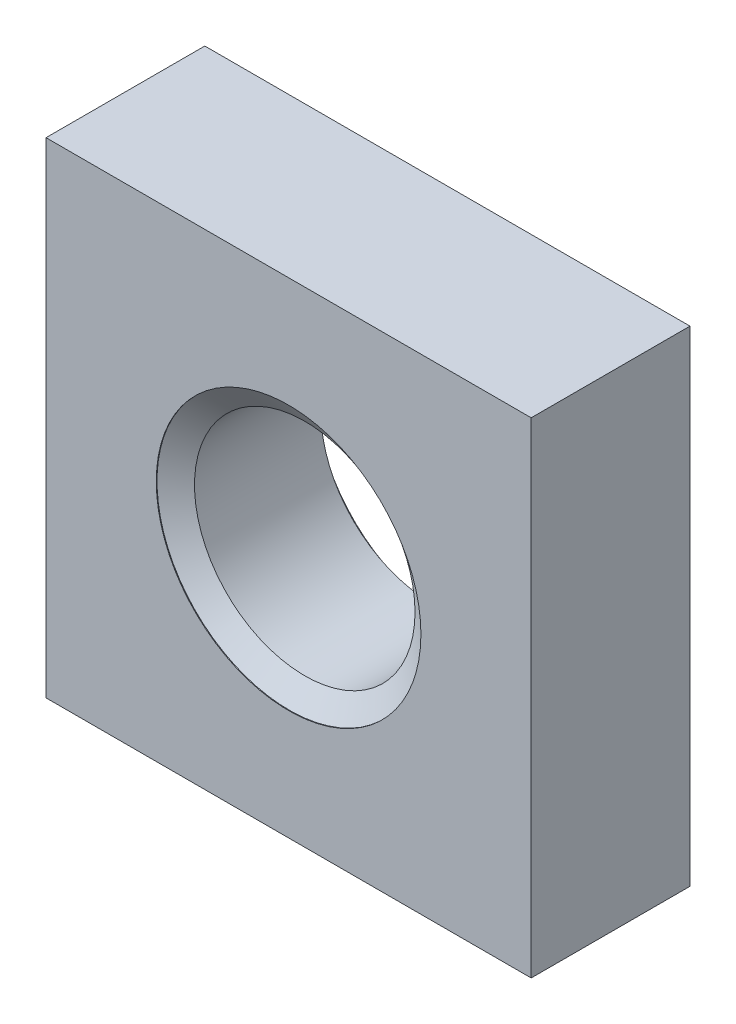
ISO-10303-21;
HEADER;
FILE_DESCRIPTION(('STEP AP214'),'2;1');
FILE_NAME('part.step','',(''),(''),'','','');
FILE_SCHEMA(('AUTOMOTIVE_DESIGN { 1 0 10303 214 1 1 1 1 }'));
ENDSEC;
DATA;
#1=APPLICATION_CONTEXT('core data for automotive mechanical design processes');
#2=APPLICATION_PROTOCOL_DEFINITION('international standard','automotive_design',2000,#1);
#3=PRODUCT_CONTEXT('',#1,'mechanical');
#4=PRODUCT('Part','Part','',(#3));
#5=PRODUCT_RELATED_PRODUCT_CATEGORY('part','',(#4));
#6=PRODUCT_DEFINITION_FORMATION('','',#4);
#7=PRODUCT_DEFINITION_CONTEXT('part definition',#1,'design');
#8=PRODUCT_DEFINITION('design','',#6,#7);
#9=PRODUCT_DEFINITION_SHAPE('','',#8);
#10=(LENGTH_UNIT() NAMED_UNIT(*) SI_UNIT(.MILLI.,.METRE.));
#11=(NAMED_UNIT(*) PLANE_ANGLE_UNIT() SI_UNIT($,.RADIAN.));
#12=(NAMED_UNIT(*) SI_UNIT($,.STERADIAN.) SOLID_ANGLE_UNIT());
#13=UNCERTAINTY_MEASURE_WITH_UNIT(LENGTH_MEASURE(1.E-05),#10,'distance_accuracy_value','');
#14=(GEOMETRIC_REPRESENTATION_CONTEXT(3) GLOBAL_UNCERTAINTY_ASSIGNED_CONTEXT((#13)) GLOBAL_UNIT_ASSIGNED_CONTEXT((#10,
#11,#12)) REPRESENTATION_CONTEXT('',''));
#15=CARTESIAN_POINT('',(0.,0.,0.));
#16=DIRECTION('',(0.,0.,1.));
#17=DIRECTION('',(1.,0.,0.));
#18=AXIS2_PLACEMENT_3D('',#15,#16,#17);
#19=CARTESIAN_POINT('',(0.,0.,-1.8));
#20=DIRECTION('',(0.,0.,1.));
#21=DIRECTION('',(1.,0.,0.));
#22=AXIS2_PLACEMENT_3D('',#19,#20,#21);
#23=CYLINDRICAL_SURFACE('',#22,1.25);
#24=CARTESIAN_POINT('',(0.,0.,-0.183051884552424));
#25=DIRECTION('',(0.,0.,1.));
#26=DIRECTION('',(1.,0.,0.));
#27=AXIS2_PLACEMENT_3D('',#24,#25,#26);
#28=CIRCLE('',#27,1.25);
#29=CARTESIAN_POINT('',(1.25,0.,-0.183051884552424));
#30=VERTEX_POINT('',#29);
#31=EDGE_CURVE('E96',#30,#30,#28,.F.);
#32=ORIENTED_EDGE('',*,*,#31,.F.);
#33=EDGE_LOOP('',(#32));
#34=FACE_BOUND('',#33,.T.);
#35=CARTESIAN_POINT('',(0.,0.,-1.61594811544757));
#36=DIRECTION('',(0.,0.,-1.));
#37=DIRECTION('',(-1.,0.,0.));
#38=AXIS2_PLACEMENT_3D('',#35,#36,#37);
#39=CIRCLE('',#38,1.25);
#40=CARTESIAN_POINT('',(-1.25,0.,-1.61594811544757));
#41=VERTEX_POINT('',#40);
#42=EDGE_CURVE('E21',#41,#41,#39,.F.);
#43=ORIENTED_EDGE('',*,*,#42,.F.);
#44=EDGE_LOOP('',(#43));
#45=FACE_BOUND('',#44,.T.);
#46=ADVANCED_FACE('F17',(#34,#45),#23,.F.);
#47=CARTESIAN_POINT('',(-2.75,-2.75,-1.8));
#48=DIRECTION('',(-1.,0.,0.));
#49=DIRECTION('',(0.,0.,1.));
#50=AXIS2_PLACEMENT_3D('',#47,#48,#49);
#51=PLANE('',#50);
#52=DIRECTION('',(0.,-1.,0.));
#53=VECTOR('',#52,1.);
#54=CARTESIAN_POINT('',(-2.75,-2.75,0.));
#55=LINE('',#54,#53);
#56=CARTESIAN_POINT('',(-2.75,2.75,0.));
#57=VERTEX_POINT('',#56);
#58=CARTESIAN_POINT('',(-2.75,-2.75,0.));
#59=VERTEX_POINT('',#58);
#60=EDGE_CURVE('E85',#57,#59,#55,.T.);
#61=ORIENTED_EDGE('',*,*,#60,.F.);
#62=DIRECTION('',(0.,0.,1.));
#63=VECTOR('',#62,1.);
#64=CARTESIAN_POINT('',(-2.75,2.75,-1.8));
#65=LINE('',#64,#63);
#66=CARTESIAN_POINT('',(-2.75,2.75,-1.8));
#67=VERTEX_POINT('',#66);
#68=EDGE_CURVE('E11',#67,#57,#65,.T.);
#69=ORIENTED_EDGE('',*,*,#68,.F.);
#70=DIRECTION('',(0.,-1.,0.));
#71=VECTOR('',#70,1.);
#72=CARTESIAN_POINT('',(-2.75,-2.75,-1.8));
#73=LINE('',#72,#71);
#74=CARTESIAN_POINT('',(-2.75,-2.75,-1.8));
#75=VERTEX_POINT('',#74);
#76=EDGE_CURVE('E78',#67,#75,#73,.T.);
#77=ORIENTED_EDGE('',*,*,#76,.T.);
#78=DIRECTION('',(0.,0.,1.));
#79=VECTOR('',#78,1.);
#80=CARTESIAN_POINT('',(-2.75,-2.75,-1.8));
#81=LINE('',#80,#79);
#82=EDGE_CURVE('E61',#75,#59,#81,.T.);
#83=ORIENTED_EDGE('',*,*,#82,.T.);
#84=EDGE_LOOP('',(#61,#69,#77,#83));
#85=FACE_BOUND('',#84,.T.);
#86=ADVANCED_FACE('F19',(#85),#51,.T.);
#87=CARTESIAN_POINT('',(-2.75,2.75,-1.8));
#88=DIRECTION('',(0.,1.,0.));
#89=DIRECTION('',(-1.,0.,0.));
#90=AXIS2_PLACEMENT_3D('',#87,#88,#89);
#91=PLANE('',#90);
#92=DIRECTION('',(-1.,0.,0.));
#93=VECTOR('',#92,1.);
#94=CARTESIAN_POINT('',(-2.75,2.75,0.));
#95=LINE('',#94,#93);
#96=CARTESIAN_POINT('',(2.75,2.75,0.));
#97=VERTEX_POINT('',#96);
#98=EDGE_CURVE('E80',#97,#57,#95,.T.);
#99=ORIENTED_EDGE('',*,*,#98,.F.);
#100=DIRECTION('',(0.,0.,1.));
#101=VECTOR('',#100,1.);
#102=CARTESIAN_POINT('',(2.75,2.75,-1.8));
#103=LINE('',#102,#101);
#104=CARTESIAN_POINT('',(2.75,2.75,-1.8));
#105=VERTEX_POINT('',#104);
#106=EDGE_CURVE('E27',#105,#97,#103,.T.);
#107=ORIENTED_EDGE('',*,*,#106,.F.);
#108=DIRECTION('',(-1.,0.,0.));
#109=VECTOR('',#108,1.);
#110=CARTESIAN_POINT('',(-2.75,2.75,-1.8));
#111=LINE('',#110,#109);
#112=EDGE_CURVE('E75',#105,#67,#111,.T.);
#113=ORIENTED_EDGE('',*,*,#112,.T.);
#114=ORIENTED_EDGE('',*,*,#68,.T.);
#115=EDGE_LOOP('',(#99,#107,#113,#114));
#116=FACE_BOUND('',#115,.T.);
#117=ADVANCED_FACE('F127',(#116),#91,.T.);
#118=CARTESIAN_POINT('',(2.75,-2.75,-1.8));
#119=DIRECTION('',(1.,0.,0.));
#120=DIRECTION('',(0.,1.,0.));
#121=AXIS2_PLACEMENT_3D('',#118,#119,#120);
#122=PLANE('',#121);
#123=DIRECTION('',(0.,1.,0.));
#124=VECTOR('',#123,1.);
#125=CARTESIAN_POINT('',(2.75,-2.75,0.));
#126=LINE('',#125,#124);
#127=CARTESIAN_POINT('',(2.75,-2.75,0.));
#128=VERTEX_POINT('',#127);
#129=EDGE_CURVE('E69',#128,#97,#126,.T.);
#130=ORIENTED_EDGE('',*,*,#129,.F.);
#131=DIRECTION('',(0.,0.,1.));
#132=VECTOR('',#131,1.);
#133=CARTESIAN_POINT('',(2.75,-2.75,-1.8));
#134=LINE('',#133,#132);
#135=CARTESIAN_POINT('',(2.75,-2.75,-1.8));
#136=VERTEX_POINT('',#135);
#137=EDGE_CURVE('E64',#136,#128,#134,.T.);
#138=ORIENTED_EDGE('',*,*,#137,.F.);
#139=DIRECTION('',(0.,1.,0.));
#140=VECTOR('',#139,1.);
#141=CARTESIAN_POINT('',(2.75,-2.75,-1.8));
#142=LINE('',#141,#140);
#143=EDGE_CURVE('E67',#136,#105,#142,.T.);
#144=ORIENTED_EDGE('',*,*,#143,.T.);
#145=ORIENTED_EDGE('',*,*,#106,.T.);
#146=EDGE_LOOP('',(#130,#138,#144,#145));
#147=FACE_BOUND('',#146,.T.);
#148=ADVANCED_FACE('F66',(#147),#122,.T.);
#149=CARTESIAN_POINT('',(-2.75,-2.75,-1.8));
#150=DIRECTION('',(0.,-1.,0.));
#151=DIRECTION('',(0.,0.,-1.));
#152=AXIS2_PLACEMENT_3D('',#149,#150,#151);
#153=PLANE('',#152);
#154=DIRECTION('',(1.,0.,0.));
#155=VECTOR('',#154,1.);
#156=CARTESIAN_POINT('',(-2.75,-2.75,0.));
#157=LINE('',#156,#155);
#158=EDGE_CURVE('E88',#59,#128,#157,.T.);
#159=ORIENTED_EDGE('',*,*,#158,.F.);
#160=ORIENTED_EDGE('',*,*,#82,.F.);
#161=DIRECTION('',(1.,0.,0.));
#162=VECTOR('',#161,1.);
#163=CARTESIAN_POINT('',(-2.75,-2.75,-1.8));
#164=LINE('',#163,#162);
#165=EDGE_CURVE('E74',#75,#136,#164,.T.);
#166=ORIENTED_EDGE('',*,*,#165,.T.);
#167=ORIENTED_EDGE('',*,*,#137,.T.);
#168=EDGE_LOOP('',(#159,#160,#166,#167));
#169=FACE_BOUND('',#168,.T.);
#170=ADVANCED_FACE('F77',(#169),#153,.T.);
#171=CARTESIAN_POINT('',(-2.75,-2.75,-1.8));
#172=DIRECTION('',(0.,0.,-1.));
#173=DIRECTION('',(-1.,0.,0.));
#174=AXIS2_PLACEMENT_3D('',#171,#172,#173);
#175=PLANE('',#174);
#176=CARTESIAN_POINT('',(0.,0.,-1.8));
#177=DIRECTION('',(0.,0.,-1.));
#178=DIRECTION('',(-1.,0.,0.));
#179=AXIS2_PLACEMENT_3D('',#176,#177,#178);
#180=CIRCLE('',#179,1.5);
#181=CARTESIAN_POINT('',(-1.5,0.,-1.8));
#182=VERTEX_POINT('',#181);
#183=EDGE_CURVE('E101',#182,#182,#180,.F.);
#184=ORIENTED_EDGE('',*,*,#183,.T.);
#185=EDGE_LOOP('',(#184));
#186=FACE_BOUND('',#185,.T.);
#187=ORIENTED_EDGE('',*,*,#76,.F.);
#188=ORIENTED_EDGE('',*,*,#112,.F.);
#189=ORIENTED_EDGE('',*,*,#143,.F.);
#190=ORIENTED_EDGE('',*,*,#165,.F.);
#191=EDGE_LOOP('',(#187,#188,#189,#190));
#192=FACE_BOUND('',#191,.T.);
#193=ADVANCED_FACE('F73',(#186,#192),#175,.T.);
#194=CARTESIAN_POINT('',(-2.75,-2.75,0.));
#195=DIRECTION('',(0.,0.,-1.));
#196=DIRECTION('',(-1.,0.,0.));
#197=AXIS2_PLACEMENT_3D('',#194,#195,#196);
#198=PLANE('',#197);
#199=CARTESIAN_POINT('',(0.,0.,0.));
#200=DIRECTION('',(0.,0.,-1.));
#201=DIRECTION('',(-1.,0.,0.));
#202=AXIS2_PLACEMENT_3D('',#199,#200,#201);
#203=CIRCLE('',#202,1.5);
#204=CARTESIAN_POINT('',(-1.5,0.,0.));
#205=VERTEX_POINT('',#204);
#206=EDGE_CURVE('E89',#205,#205,#203,.F.);
#207=ORIENTED_EDGE('',*,*,#206,.F.);
#208=EDGE_LOOP('',(#207));
#209=FACE_BOUND('',#208,.T.);
#210=ORIENTED_EDGE('',*,*,#60,.T.);
#211=ORIENTED_EDGE('',*,*,#158,.T.);
#212=ORIENTED_EDGE('',*,*,#129,.T.);
#213=ORIENTED_EDGE('',*,*,#98,.T.);
#214=EDGE_LOOP('',(#210,#211,#212,#213));
#215=FACE_BOUND('',#214,.T.);
#216=ADVANCED_FACE('F120',(#209,#215),#198,.F.);
#217=CARTESIAN_POINT('',(0.,0.,-25.0375057290932));
#218=DIRECTION('',(0.,0.,1.));
#219=DIRECTION('',(1.,0.,0.));
#220=AXIS2_PLACEMENT_3D('',#217,#218,#219);
#221=CYLINDRICAL_SURFACE('',#220,1.5);
#222=CARTESIAN_POINT('',(0.,0.,-0.00799999999999759));
#223=DIRECTION('',(0.,0.,1.));
#224=DIRECTION('',(1.,0.,0.));
#225=AXIS2_PLACEMENT_3D('',#222,#223,#224);
#226=CIRCLE('',#225,1.5);
#227=CARTESIAN_POINT('',(1.5,0.,-0.00799999999999759));
#228=VERTEX_POINT('',#227);
#229=EDGE_CURVE('E99',#228,#228,#226,.T.);
#230=ORIENTED_EDGE('',*,*,#229,.F.);
#231=EDGE_LOOP('',(#230));
#232=FACE_BOUND('',#231,.T.);
#233=ORIENTED_EDGE('',*,*,#206,.T.);
#234=EDGE_LOOP('',(#233));
#235=FACE_BOUND('',#234,.T.);
#236=ADVANCED_FACE('F117',(#232,#235),#221,.F.);
#237=CARTESIAN_POINT('',(0.,0.,-0.200557073007667));
#238=DIRECTION('',(0.,0.,1.));
#239=DIRECTION('',(1.,0.,0.));
#240=AXIS2_PLACEMENT_3D('',#237,#238,#239);
#241=CONICAL_SURFACE('',#240,1.225,0.959931088596884);
#242=ORIENTED_EDGE('',*,*,#229,.T.);
#243=EDGE_LOOP('',(#242));
#244=FACE_BOUND('',#243,.T.);
#245=ORIENTED_EDGE('',*,*,#31,.T.);
#246=EDGE_LOOP('',(#245));
#247=FACE_BOUND('',#246,.T.);
#248=ADVANCED_FACE('F114',(#244,#247),#241,.F.);
#249=CARTESIAN_POINT('',(0.,0.,-1.791));
#250=DIRECTION('',(0.,0.,-1.));
#251=DIRECTION('',(-1.,0.,0.));
#252=AXIS2_PLACEMENT_3D('',#249,#250,#251);
#253=CONICAL_SURFACE('',#252,1.5,0.959931088596884);
#254=CARTESIAN_POINT('',(0.,0.,-1.791));
#255=DIRECTION('',(0.,0.,1.));
#256=DIRECTION('',(1.,0.,0.));
#257=AXIS2_PLACEMENT_3D('',#254,#255,#256);
#258=CIRCLE('',#257,1.5);
#259=CARTESIAN_POINT('',(1.5,0.,-1.791));
#260=VERTEX_POINT('',#259);
#261=EDGE_CURVE('E103',#260,#260,#258,.T.);
#262=ORIENTED_EDGE('',*,*,#261,.F.);
#263=EDGE_LOOP('',(#262));
#264=FACE_BOUND('',#263,.T.);
#265=ORIENTED_EDGE('',*,*,#42,.T.);
#266=EDGE_LOOP('',(#265));
#267=FACE_BOUND('',#266,.T.);
#268=ADVANCED_FACE('F193',(#264,#267),#253,.F.);
#269=CARTESIAN_POINT('',(0.,0.,-25.0375057290932));
#270=DIRECTION('',(0.,0.,1.));
#271=DIRECTION('',(1.,0.,0.));
#272=AXIS2_PLACEMENT_3D('',#269,#270,#271);
#273=CYLINDRICAL_SURFACE('',#272,1.5);
#274=ORIENTED_EDGE('',*,*,#183,.F.);
#275=EDGE_LOOP('',(#274));
#276=FACE_BOUND('',#275,.T.);
#277=ORIENTED_EDGE('',*,*,#261,.T.);
#278=EDGE_LOOP('',(#277));
#279=FACE_BOUND('',#278,.T.);
#280=ADVANCED_FACE('F201',(#276,#279),#273,.F.);
#281=CLOSED_SHELL('',(#46,#86,#117,#148,#170,#193,#216,#236,#248,#268,#280));
#282=MANIFOLD_SOLID_BREP('B1',#281);
#283=ADVANCED_BREP_SHAPE_REPRESENTATION('',(#18,#282),#14);
#284=SHAPE_DEFINITION_REPRESENTATION(#9,#283);
ENDSEC;
END-ISO-10303-21;
